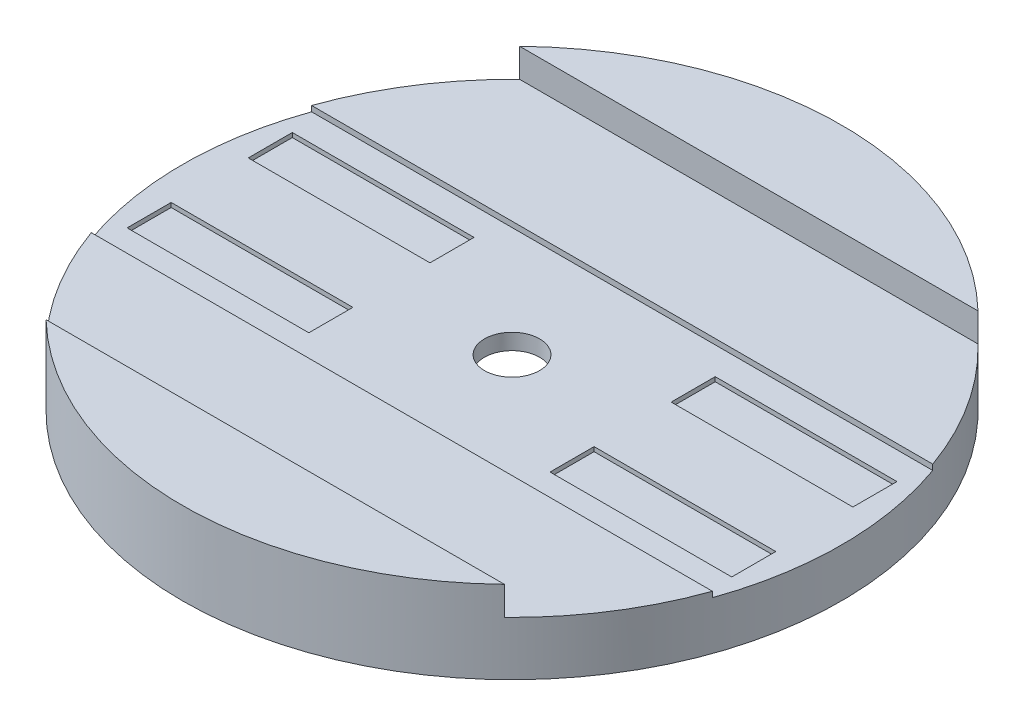
ISO-10303-21;
HEADER;
FILE_DESCRIPTION(('STEP AP214'),'2;1');
FILE_NAME('part.step','',(''),(''),'','','');
FILE_SCHEMA(('AUTOMOTIVE_DESIGN { 1 0 10303 214 1 1 1 1 }'));
ENDSEC;
DATA;
#1=APPLICATION_CONTEXT('core data for automotive mechanical design processes');
#2=APPLICATION_PROTOCOL_DEFINITION('international standard','automotive_design',2000,#1);
#3=PRODUCT_CONTEXT('',#1,'mechanical');
#4=PRODUCT('Part','Part','',(#3));
#5=PRODUCT_RELATED_PRODUCT_CATEGORY('part','',(#4));
#6=PRODUCT_DEFINITION_FORMATION('','',#4);
#7=PRODUCT_DEFINITION_CONTEXT('part definition',#1,'design');
#8=PRODUCT_DEFINITION('design','',#6,#7);
#9=PRODUCT_DEFINITION_SHAPE('','',#8);
#10=(LENGTH_UNIT() NAMED_UNIT(*) SI_UNIT(.MILLI.,.METRE.));
#11=(NAMED_UNIT(*) PLANE_ANGLE_UNIT() SI_UNIT($,.RADIAN.));
#12=(NAMED_UNIT(*) SI_UNIT($,.STERADIAN.) SOLID_ANGLE_UNIT());
#13=UNCERTAINTY_MEASURE_WITH_UNIT(LENGTH_MEASURE(1.E-05),#10,'distance_accuracy_value','');
#14=(GEOMETRIC_REPRESENTATION_CONTEXT(3) GLOBAL_UNCERTAINTY_ASSIGNED_CONTEXT((#13)) GLOBAL_UNIT_ASSIGNED_CONTEXT((#10,
#11,#12)) REPRESENTATION_CONTEXT('',''));
#15=CARTESIAN_POINT('',(0.,0.,0.));
#16=DIRECTION('',(0.,0.,1.));
#17=DIRECTION('',(1.,0.,0.));
#18=AXIS2_PLACEMENT_3D('',#15,#16,#17);
#19=CARTESIAN_POINT('',(0.,-7.554,0.));
#20=DIRECTION('',(0.,1.,0.));
#21=DIRECTION('',(0.,0.,1.));
#22=AXIS2_PLACEMENT_3D('',#19,#20,#21);
#23=CYLINDRICAL_SURFACE('',#22,6.35);
#24=CARTESIAN_POINT('',(0.,7.5,0.));
#25=DIRECTION('',(0.,-1.,0.));
#26=DIRECTION('',(0.,0.,-1.));
#27=AXIS2_PLACEMENT_3D('',#24,#25,#26);
#28=CIRCLE('',#27,6.35);
#29=CARTESIAN_POINT('',(0.,7.5,-6.35));
#30=VERTEX_POINT('',#29);
#31=EDGE_CURVE('E375',#30,#30,#28,.F.);
#32=ORIENTED_EDGE('',*,*,#31,.F.);
#33=EDGE_LOOP('',(#32));
#34=FACE_BOUND('',#33,.T.);
#35=CARTESIAN_POINT('',(0.,11.176,0.));
#36=DIRECTION('',(0.,1.,0.));
#37=DIRECTION('',(0.,0.,1.));
#38=AXIS2_PLACEMENT_3D('',#35,#36,#37);
#39=CIRCLE('',#38,6.35);
#40=CARTESIAN_POINT('',(0.,11.176,6.35));
#41=VERTEX_POINT('',#40);
#42=EDGE_CURVE('E368',#41,#41,#39,.F.);
#43=ORIENTED_EDGE('',*,*,#42,.F.);
#44=EDGE_LOOP('',(#43));
#45=FACE_BOUND('',#44,.T.);
#46=ADVANCED_FACE('F59',(#34,#45),#23,.F.);
#47=CARTESIAN_POINT('',(-58.0079555223723,12.446,0.));
#48=DIRECTION('',(0.,1.,0.));
#49=DIRECTION('',(0.,0.,1.));
#50=AXIS2_PLACEMENT_3D('',#47,#48,#49);
#51=PLANE('',#50);
#52=DIRECTION('',(1.,0.,0.));
#53=VECTOR('',#52,1.);
#54=CARTESIAN_POINT('',(-58.0079555223722,12.446,25.4));
#55=LINE('',#54,#53);
#56=CARTESIAN_POINT('',(-71.6298820325707,12.446,25.4));
#57=VERTEX_POINT('',#56);
#58=CARTESIAN_POINT('',(71.6298820325707,12.446,25.4));
#59=VERTEX_POINT('',#58);
#60=EDGE_CURVE('E416',#57,#59,#55,.T.);
#61=ORIENTED_EDGE('',*,*,#60,.F.);
#62=CARTESIAN_POINT('',(0.,12.446,0.));
#63=DIRECTION('',(0.,1.,0.));
#64=DIRECTION('',(0.,0.,1.));
#65=AXIS2_PLACEMENT_3D('',#62,#63,#64);
#66=CIRCLE('',#65,76.);
#67=CARTESIAN_POINT('',(-52.8559164143429,12.446,54.61));
#68=VERTEX_POINT('',#67);
#69=EDGE_CURVE('E407',#57,#68,#66,.T.);
#70=ORIENTED_EDGE('',*,*,#69,.T.);
#71=DIRECTION('',(1.,0.,0.));
#72=VECTOR('',#71,1.);
#73=CARTESIAN_POINT('',(-58.0079555223723,12.446,54.61));
#74=LINE('',#73,#72);
#75=CARTESIAN_POINT('',(52.8559164143429,12.446,54.61));
#76=VERTEX_POINT('',#75);
#77=EDGE_CURVE('E378',#68,#76,#74,.T.);
#78=ORIENTED_EDGE('',*,*,#77,.T.);
#79=EDGE_CURVE('E412',#76,#59,#66,.T.);
#80=ORIENTED_EDGE('',*,*,#79,.T.);
#81=EDGE_LOOP('',(#61,#70,#78,#80));
#82=FACE_BOUND('',#81,.T.);
#83=ADVANCED_FACE('F438',(#82),#51,.T.);
#84=CARTESIAN_POINT('',(0.,19.05,0.));
#85=DIRECTION('',(0.,1.,0.));
#86=DIRECTION('',(0.,0.,1.));
#87=AXIS2_PLACEMENT_3D('',#84,#85,#86);
#88=PLANE('',#87);
#89=DIRECTION('',(-1.,0.,0.));
#90=VECTOR('',#89,1.);
#91=CARTESIAN_POINT('',(0.,19.05,-54.61));
#92=LINE('',#91,#90);
#93=CARTESIAN_POINT('',(52.8559164143428,19.05,-54.61));
#94=VERTEX_POINT('',#93);
#95=CARTESIAN_POINT('',(-52.8559164143428,19.05,-54.61));
#96=VERTEX_POINT('',#95);
#97=EDGE_CURVE('E405',#94,#96,#92,.T.);
#98=ORIENTED_EDGE('',*,*,#97,.F.);
#99=CARTESIAN_POINT('',(0.,19.05,0.));
#100=DIRECTION('',(0.,1.,0.));
#101=DIRECTION('',(0.,0.,1.));
#102=AXIS2_PLACEMENT_3D('',#99,#100,#101);
#103=CIRCLE('',#102,76.);
#104=EDGE_CURVE('E400',#94,#96,#103,.T.);
#105=ORIENTED_EDGE('',*,*,#104,.T.);
#106=EDGE_LOOP('',(#98,#105));
#107=FACE_BOUND('',#106,.T.);
#108=ADVANCED_FACE('F449',(#107),#88,.T.);
#109=CARTESIAN_POINT('',(0.,19.05,0.));
#110=DIRECTION('',(0.,-1.,0.));
#111=DIRECTION('',(0.,0.,-1.));
#112=AXIS2_PLACEMENT_3D('',#109,#110,#111);
#113=CYLINDRICAL_SURFACE('',#112,76.);
#114=CARTESIAN_POINT('',(0.,11.176,0.));
#115=DIRECTION('',(0.,1.,0.));
#116=DIRECTION('',(0.,0.,1.));
#117=AXIS2_PLACEMENT_3D('',#114,#115,#116);
#118=CIRCLE('',#117,76.);
#119=CARTESIAN_POINT('',(71.6298820325707,11.176,25.4));
#120=VERTEX_POINT('',#119);
#121=CARTESIAN_POINT('',(71.6298820325707,11.176,-25.4000000000001));
#122=VERTEX_POINT('',#121);
#123=EDGE_CURVE('E12',#120,#122,#118,.T.);
#124=ORIENTED_EDGE('',*,*,#123,.F.);
#125=DIRECTION('',(0.,-1.,0.));
#126=VECTOR('',#125,1.);
#127=CARTESIAN_POINT('',(71.6298820325707,19.05,25.4));
#128=LINE('',#127,#126);
#129=EDGE_CURVE('E362',#120,#59,#128,.F.);
#130=ORIENTED_EDGE('',*,*,#129,.T.);
#131=ORIENTED_EDGE('',*,*,#79,.F.);
#132=DIRECTION('',(0.,-1.,0.));
#133=VECTOR('',#132,1.);
#134=CARTESIAN_POINT('',(52.8559164143429,19.05,54.61));
#135=LINE('',#134,#133);
#136=CARTESIAN_POINT('',(52.8559164143428,19.05,54.61));
#137=VERTEX_POINT('',#136);
#138=EDGE_CURVE('E384',#76,#137,#135,.F.);
#139=ORIENTED_EDGE('',*,*,#138,.T.);
#140=CARTESIAN_POINT('',(-52.8559164143429,19.05,54.61));
#141=VERTEX_POINT('',#140);
#142=EDGE_CURVE('E397',#141,#137,#103,.T.);
#143=ORIENTED_EDGE('',*,*,#142,.F.);
#144=DIRECTION('',(0.,-1.,0.));
#145=VECTOR('',#144,1.);
#146=CARTESIAN_POINT('',(-52.8559164143429,19.05,54.61));
#147=LINE('',#146,#145);
#148=EDGE_CURVE('E387',#141,#68,#147,.T.);
#149=ORIENTED_EDGE('',*,*,#148,.T.);
#150=ORIENTED_EDGE('',*,*,#69,.F.);
#151=DIRECTION('',(0.,-1.,0.));
#152=VECTOR('',#151,1.);
#153=CARTESIAN_POINT('',(-71.6298820325707,19.05,25.4));
#154=LINE('',#153,#152);
#155=CARTESIAN_POINT('',(-71.6298820325707,11.176,25.4));
#156=VERTEX_POINT('',#155);
#157=EDGE_CURVE('E365',#57,#156,#154,.T.);
#158=ORIENTED_EDGE('',*,*,#157,.T.);
#159=CARTESIAN_POINT('',(-71.6298820325707,11.176,-25.4));
#160=VERTEX_POINT('',#159);
#161=EDGE_CURVE('E63',#160,#156,#118,.T.);
#162=ORIENTED_EDGE('',*,*,#161,.F.);
#163=DIRECTION('',(0.,-1.,0.));
#164=VECTOR('',#163,1.);
#165=CARTESIAN_POINT('',(-71.6298820325707,19.05,-25.4));
#166=LINE('',#165,#164);
#167=CARTESIAN_POINT('',(-71.6298820325708,12.446,-25.4));
#168=VERTEX_POINT('',#167);
#169=EDGE_CURVE('E356',#160,#168,#166,.F.);
#170=ORIENTED_EDGE('',*,*,#169,.T.);
#171=CARTESIAN_POINT('',(-52.8559164143428,12.446,-54.61));
#172=VERTEX_POINT('',#171);
#173=EDGE_CURVE('E408',#172,#168,#66,.T.);
#174=ORIENTED_EDGE('',*,*,#173,.F.);
#175=DIRECTION('',(0.,-1.,0.));
#176=VECTOR('',#175,1.);
#177=CARTESIAN_POINT('',(-52.8559164143428,19.05,-54.61));
#178=LINE('',#177,#176);
#179=EDGE_CURVE('E390',#172,#96,#178,.F.);
#180=ORIENTED_EDGE('',*,*,#179,.T.);
#181=ORIENTED_EDGE('',*,*,#104,.F.);
#182=DIRECTION('',(0.,-1.,0.));
#183=VECTOR('',#182,1.);
#184=CARTESIAN_POINT('',(52.8559164143428,19.05,-54.61));
#185=LINE('',#184,#183);
#186=CARTESIAN_POINT('',(52.8559164143428,12.446,-54.61));
#187=VERTEX_POINT('',#186);
#188=EDGE_CURVE('E393',#94,#187,#185,.T.);
#189=ORIENTED_EDGE('',*,*,#188,.T.);
#190=CARTESIAN_POINT('',(71.6298820325707,12.446,-25.4000000000001));
#191=VERTEX_POINT('',#190);
#192=EDGE_CURVE('E411',#191,#187,#66,.T.);
#193=ORIENTED_EDGE('',*,*,#192,.F.);
#194=DIRECTION('',(0.,-1.,0.));
#195=VECTOR('',#194,1.);
#196=CARTESIAN_POINT('',(71.6298820325707,19.05,-25.4000000000001));
#197=LINE('',#196,#195);
#198=EDGE_CURVE('E359',#191,#122,#197,.T.);
#199=ORIENTED_EDGE('',*,*,#198,.T.);
#200=EDGE_LOOP('',(#124,#130,#131,#139,#143,#149,#150,#158,#162,#170,#174,#180,#181,#189,#193,#199));
#201=FACE_BOUND('',#200,.T.);
#202=CARTESIAN_POINT('',(0.,0.,0.));
#203=DIRECTION('',(0.,1.,0.));
#204=DIRECTION('',(0.,0.,1.));
#205=AXIS2_PLACEMENT_3D('',#202,#203,#204);
#206=CIRCLE('',#205,76.);
#207=CARTESIAN_POINT('',(0.,0.,76.));
#208=VERTEX_POINT('',#207);
#209=EDGE_CURVE('E396',#208,#208,#206,.T.);
#210=ORIENTED_EDGE('',*,*,#209,.T.);
#211=EDGE_LOOP('',(#210));
#212=FACE_BOUND('',#211,.T.);
#213=ADVANCED_FACE('F61',(#201,#212),#113,.T.);
#214=DIRECTION('',(1.,0.,0.));
#215=VECTOR('',#214,1.);
#216=CARTESIAN_POINT('',(0.,19.05,54.61));
#217=LINE('',#216,#215);
#218=EDGE_CURVE('E403',#141,#137,#217,.T.);
#219=ORIENTED_EDGE('',*,*,#218,.F.);
#220=ORIENTED_EDGE('',*,*,#142,.T.);
#221=EDGE_LOOP('',(#219,#220));
#222=FACE_BOUND('',#221,.T.);
#223=ADVANCED_FACE('F452',(#222),#88,.T.);
#224=CARTESIAN_POINT('',(0.,0.,0.));
#225=DIRECTION('',(0.,1.,0.));
#226=DIRECTION('',(0.,0.,1.));
#227=AXIS2_PLACEMENT_3D('',#224,#225,#226);
#228=PLANE('',#227);
#229=CARTESIAN_POINT('',(0.,0.,0.));
#230=DIRECTION('',(0.,-1.,0.));
#231=DIRECTION('',(0.,0.,-1.));
#232=AXIS2_PLACEMENT_3D('',#229,#230,#231);
#233=CIRCLE('',#232,70.);
#234=CARTESIAN_POINT('',(0.,0.,-70.));
#235=VERTEX_POINT('',#234);
#236=EDGE_CURVE('E371',#235,#235,#233,.T.);
#237=ORIENTED_EDGE('',*,*,#236,.F.);
#238=EDGE_LOOP('',(#237));
#239=FACE_BOUND('',#238,.T.);
#240=ORIENTED_EDGE('',*,*,#209,.F.);
#241=EDGE_LOOP('',(#240));
#242=FACE_BOUND('',#241,.T.);
#243=ADVANCED_FACE('F460',(#239,#242),#228,.F.);
#244=DIRECTION('',(-1.,0.,0.));
#245=VECTOR('',#244,1.);
#246=CARTESIAN_POINT('',(-58.0079555223723,12.446,-25.4));
#247=LINE('',#246,#245);
#248=EDGE_CURVE('E415',#191,#168,#247,.T.);
#249=ORIENTED_EDGE('',*,*,#248,.F.);
#250=ORIENTED_EDGE('',*,*,#192,.T.);
#251=DIRECTION('',(-1.,0.,0.));
#252=VECTOR('',#251,1.);
#253=CARTESIAN_POINT('',(-58.0079555223723,12.446,-54.61));
#254=LINE('',#253,#252);
#255=EDGE_CURVE('E381',#187,#172,#254,.T.);
#256=ORIENTED_EDGE('',*,*,#255,.T.);
#257=ORIENTED_EDGE('',*,*,#173,.T.);
#258=EDGE_LOOP('',(#249,#250,#256,#257));
#259=FACE_BOUND('',#258,.T.);
#260=ADVANCED_FACE('F442',(#259),#51,.T.);
#261=CARTESIAN_POINT('',(-58.0079555223723,12.446,-54.61));
#262=DIRECTION('',(0.,0.,-1.));
#263=DIRECTION('',(-1.,0.,0.));
#264=AXIS2_PLACEMENT_3D('',#261,#262,#263);
#265=PLANE('',#264);
#266=ORIENTED_EDGE('',*,*,#97,.T.);
#267=ORIENTED_EDGE('',*,*,#179,.F.);
#268=ORIENTED_EDGE('',*,*,#255,.F.);
#269=ORIENTED_EDGE('',*,*,#188,.F.);
#270=EDGE_LOOP('',(#266,#267,#268,#269));
#271=FACE_BOUND('',#270,.T.);
#272=ADVANCED_FACE('F444',(#271),#265,.F.);
#273=CARTESIAN_POINT('',(-58.0079555223723,12.446,54.61));
#274=DIRECTION('',(0.,0.,1.));
#275=DIRECTION('',(1.,0.,0.));
#276=AXIS2_PLACEMENT_3D('',#273,#274,#275);
#277=PLANE('',#276);
#278=ORIENTED_EDGE('',*,*,#218,.T.);
#279=ORIENTED_EDGE('',*,*,#138,.F.);
#280=ORIENTED_EDGE('',*,*,#77,.F.);
#281=ORIENTED_EDGE('',*,*,#148,.F.);
#282=EDGE_LOOP('',(#278,#279,#280,#281));
#283=FACE_BOUND('',#282,.T.);
#284=ADVANCED_FACE('F476',(#283),#277,.F.);
#285=CARTESIAN_POINT('',(0.,7.5,0.));
#286=DIRECTION('',(0.,-1.,0.));
#287=DIRECTION('',(0.,0.,-1.));
#288=AXIS2_PLACEMENT_3D('',#285,#286,#287);
#289=PLANE('',#288);
#290=CARTESIAN_POINT('',(0.,7.5,0.));
#291=DIRECTION('',(0.,-1.,0.));
#292=DIRECTION('',(0.,0.,-1.));
#293=AXIS2_PLACEMENT_3D('',#290,#291,#292);
#294=CIRCLE('',#293,70.);
#295=CARTESIAN_POINT('',(0.,7.5,-70.));
#296=VERTEX_POINT('',#295);
#297=EDGE_CURVE('E372',#296,#296,#294,.T.);
#298=ORIENTED_EDGE('',*,*,#297,.T.);
#299=EDGE_LOOP('',(#298));
#300=FACE_BOUND('',#299,.T.);
#301=ORIENTED_EDGE('',*,*,#31,.T.);
#302=EDGE_LOOP('',(#301));
#303=FACE_BOUND('',#302,.T.);
#304=ADVANCED_FACE('F478',(#300,#303),#289,.T.);
#305=CARTESIAN_POINT('',(0.,7.5,0.));
#306=DIRECTION('',(0.,-1.,0.));
#307=DIRECTION('',(0.,0.,-1.));
#308=AXIS2_PLACEMENT_3D('',#305,#306,#307);
#309=CYLINDRICAL_SURFACE('',#308,70.);
#310=ORIENTED_EDGE('',*,*,#297,.F.);
#311=EDGE_LOOP('',(#310));
#312=FACE_BOUND('',#311,.T.);
#313=ORIENTED_EDGE('',*,*,#236,.T.);
#314=EDGE_LOOP('',(#313));
#315=FACE_BOUND('',#314,.T.);
#316=ADVANCED_FACE('F471',(#312,#315),#309,.F.);
#317=CARTESIAN_POINT('',(76.,11.176,0.));
#318=DIRECTION('',(0.,1.,0.));
#319=DIRECTION('',(0.,0.,1.));
#320=AXIS2_PLACEMENT_3D('',#317,#318,#319);
#321=PLANE('',#320);
#322=DIRECTION('',(0.,0.,-1.));
#323=VECTOR('',#322,1.);
#324=CARTESIAN_POINT('',(69.723,11.176,-19.05));
#325=LINE('',#324,#323);
#326=CARTESIAN_POINT('',(69.723,11.176,-8.89000000000003));
#327=VERTEX_POINT('',#326);
#328=CARTESIAN_POINT('',(69.723,11.176,-19.05));
#329=VERTEX_POINT('',#328);
#330=EDGE_CURVE('E74',#327,#329,#325,.T.);
#331=ORIENTED_EDGE('',*,*,#330,.F.);
#332=DIRECTION('',(1.,0.,0.));
#333=VECTOR('',#332,1.);
#334=CARTESIAN_POINT('',(69.723,11.176,-8.89000000000003));
#335=LINE('',#334,#333);
#336=CARTESIAN_POINT('',(27.813,11.176,-8.89000000000002));
#337=VERTEX_POINT('',#336);
#338=EDGE_CURVE('E300',#337,#327,#335,.T.);
#339=ORIENTED_EDGE('',*,*,#338,.F.);
#340=DIRECTION('',(0.,0.,1.));
#341=VECTOR('',#340,1.);
#342=CARTESIAN_POINT('',(27.813,11.176,-19.05));
#343=LINE('',#342,#341);
#344=CARTESIAN_POINT('',(27.813,11.176,-19.05));
#345=VERTEX_POINT('',#344);
#346=EDGE_CURVE('E303',#345,#337,#343,.T.);
#347=ORIENTED_EDGE('',*,*,#346,.F.);
#348=DIRECTION('',(-1.,0.,0.));
#349=VECTOR('',#348,1.);
#350=CARTESIAN_POINT('',(69.723,11.176,-19.05));
#351=LINE('',#350,#349);
#352=EDGE_CURVE('E307',#329,#345,#351,.T.);
#353=ORIENTED_EDGE('',*,*,#352,.F.);
#354=EDGE_LOOP('',(#331,#339,#347,#353));
#355=FACE_BOUND('',#354,.T.);
#356=DIRECTION('',(1.,0.,0.));
#357=VECTOR('',#356,1.);
#358=CARTESIAN_POINT('',(69.723,11.176,19.05));
#359=LINE('',#358,#357);
#360=CARTESIAN_POINT('',(27.813,11.176,19.05));
#361=VERTEX_POINT('',#360);
#362=CARTESIAN_POINT('',(69.723,11.176,19.05));
#363=VERTEX_POINT('',#362);
#364=EDGE_CURVE('E82',#361,#363,#359,.T.);
#365=ORIENTED_EDGE('',*,*,#364,.F.);
#366=DIRECTION('',(0.,0.,1.));
#367=VECTOR('',#366,1.);
#368=CARTESIAN_POINT('',(27.813,11.176,19.05));
#369=LINE('',#368,#367);
#370=CARTESIAN_POINT('',(27.813,11.176,8.89000000000001));
#371=VERTEX_POINT('',#370);
#372=EDGE_CURVE('E270',#371,#361,#369,.T.);
#373=ORIENTED_EDGE('',*,*,#372,.F.);
#374=DIRECTION('',(-1.,0.,0.));
#375=VECTOR('',#374,1.);
#376=CARTESIAN_POINT('',(69.723,11.176,8.89));
#377=LINE('',#376,#375);
#378=CARTESIAN_POINT('',(69.723,11.176,8.89));
#379=VERTEX_POINT('',#378);
#380=EDGE_CURVE('E273',#379,#371,#377,.T.);
#381=ORIENTED_EDGE('',*,*,#380,.F.);
#382=DIRECTION('',(0.,0.,-1.));
#383=VECTOR('',#382,1.);
#384=CARTESIAN_POINT('',(69.723,11.176,19.05));
#385=LINE('',#384,#383);
#386=EDGE_CURVE('E277',#363,#379,#385,.T.);
#387=ORIENTED_EDGE('',*,*,#386,.F.);
#388=EDGE_LOOP('',(#365,#373,#381,#387));
#389=FACE_BOUND('',#388,.T.);
#390=DIRECTION('',(0.,0.,1.));
#391=VECTOR('',#390,1.);
#392=CARTESIAN_POINT('',(-69.723,11.176,19.05));
#393=LINE('',#392,#391);
#394=CARTESIAN_POINT('',(-69.723,11.176,8.89000000000001));
#395=VERTEX_POINT('',#394);
#396=CARTESIAN_POINT('',(-69.723,11.176,19.05));
#397=VERTEX_POINT('',#396);
#398=EDGE_CURVE('E222',#395,#397,#393,.T.);
#399=ORIENTED_EDGE('',*,*,#398,.F.);
#400=DIRECTION('',(-1.,0.,0.));
#401=VECTOR('',#400,1.);
#402=CARTESIAN_POINT('',(-69.723,11.176,8.89000000000001));
#403=LINE('',#402,#401);
#404=CARTESIAN_POINT('',(-27.813,11.176,8.89000000000001));
#405=VERTEX_POINT('',#404);
#406=EDGE_CURVE('E232',#405,#395,#403,.T.);
#407=ORIENTED_EDGE('',*,*,#406,.F.);
#408=DIRECTION('',(0.,0.,-1.));
#409=VECTOR('',#408,1.);
#410=CARTESIAN_POINT('',(-27.813,11.176,19.05));
#411=LINE('',#410,#409);
#412=CARTESIAN_POINT('',(-27.813,11.176,19.05));
#413=VERTEX_POINT('',#412);
#414=EDGE_CURVE('E237',#413,#405,#411,.T.);
#415=ORIENTED_EDGE('',*,*,#414,.F.);
#416=DIRECTION('',(1.,0.,0.));
#417=VECTOR('',#416,1.);
#418=CARTESIAN_POINT('',(-69.723,11.176,19.05));
#419=LINE('',#418,#417);
#420=EDGE_CURVE('E243',#397,#413,#419,.T.);
#421=ORIENTED_EDGE('',*,*,#420,.F.);
#422=EDGE_LOOP('',(#399,#407,#415,#421));
#423=FACE_BOUND('',#422,.T.);
#424=DIRECTION('',(0.,0.,1.));
#425=VECTOR('',#424,1.);
#426=CARTESIAN_POINT('',(-69.723,11.176,-19.05));
#427=LINE('',#426,#425);
#428=CARTESIAN_POINT('',(-69.723,11.176,-19.05));
#429=VERTEX_POINT('',#428);
#430=CARTESIAN_POINT('',(-69.723,11.176,-8.89000000000001));
#431=VERTEX_POINT('',#430);
#432=EDGE_CURVE('E244',#429,#431,#427,.T.);
#433=ORIENTED_EDGE('',*,*,#432,.F.);
#434=DIRECTION('',(-1.,0.,0.));
#435=VECTOR('',#434,1.);
#436=CARTESIAN_POINT('',(-69.723,11.176,-19.05));
#437=LINE('',#436,#435);
#438=CARTESIAN_POINT('',(-27.813,11.176,-19.05));
#439=VERTEX_POINT('',#438);
#440=EDGE_CURVE('E325',#439,#429,#437,.T.);
#441=ORIENTED_EDGE('',*,*,#440,.F.);
#442=DIRECTION('',(0.,0.,-1.));
#443=VECTOR('',#442,1.);
#444=CARTESIAN_POINT('',(-27.813,11.176,-19.05));
#445=LINE('',#444,#443);
#446=CARTESIAN_POINT('',(-27.813,11.176,-8.89000000000001));
#447=VERTEX_POINT('',#446);
#448=EDGE_CURVE('E337',#447,#439,#445,.T.);
#449=ORIENTED_EDGE('',*,*,#448,.F.);
#450=DIRECTION('',(1.,0.,0.));
#451=VECTOR('',#450,1.);
#452=CARTESIAN_POINT('',(-69.723,11.176,-8.89000000000001));
#453=LINE('',#452,#451);
#454=EDGE_CURVE('E246',#431,#447,#453,.T.);
#455=ORIENTED_EDGE('',*,*,#454,.F.);
#456=EDGE_LOOP('',(#433,#441,#449,#455));
#457=FACE_BOUND('',#456,.T.);
#458=ORIENTED_EDGE('',*,*,#123,.T.);
#459=DIRECTION('',(-1.,0.,0.));
#460=VECTOR('',#459,1.);
#461=CARTESIAN_POINT('',(76.,11.176,-25.4000000000001));
#462=LINE('',#461,#460);
#463=EDGE_CURVE('E344',#122,#160,#462,.T.);
#464=ORIENTED_EDGE('',*,*,#463,.T.);
#465=ORIENTED_EDGE('',*,*,#161,.T.);
#466=DIRECTION('',(1.,0.,0.));
#467=VECTOR('',#466,1.);
#468=CARTESIAN_POINT('',(76.,11.176,25.4));
#469=LINE('',#468,#467);
#470=EDGE_CURVE('E353',#156,#120,#469,.T.);
#471=ORIENTED_EDGE('',*,*,#470,.T.);
#472=EDGE_LOOP('',(#458,#464,#465,#471));
#473=FACE_BOUND('',#472,.T.);
#474=ORIENTED_EDGE('',*,*,#42,.T.);
#475=EDGE_LOOP('',(#474));
#476=FACE_BOUND('',#475,.T.);
#477=ADVANCED_FACE('F240',(#355,#389,#423,#457,#473,#476),#321,.T.);
#478=CARTESIAN_POINT('',(76.,11.176,25.4));
#479=DIRECTION('',(0.,0.,1.));
#480=DIRECTION('',(1.,0.,0.));
#481=AXIS2_PLACEMENT_3D('',#478,#479,#480);
#482=PLANE('',#481);
#483=ORIENTED_EDGE('',*,*,#60,.T.);
#484=ORIENTED_EDGE('',*,*,#129,.F.);
#485=ORIENTED_EDGE('',*,*,#470,.F.);
#486=ORIENTED_EDGE('',*,*,#157,.F.);
#487=EDGE_LOOP('',(#483,#484,#485,#486));
#488=FACE_BOUND('',#487,.T.);
#489=ADVANCED_FACE('F426',(#488),#482,.F.);
#490=CARTESIAN_POINT('',(76.,11.176,-25.4000000000001));
#491=DIRECTION('',(0.,0.,-1.));
#492=DIRECTION('',(-1.,0.,0.));
#493=AXIS2_PLACEMENT_3D('',#490,#491,#492);
#494=PLANE('',#493);
#495=ORIENTED_EDGE('',*,*,#248,.T.);
#496=ORIENTED_EDGE('',*,*,#169,.F.);
#497=ORIENTED_EDGE('',*,*,#463,.F.);
#498=ORIENTED_EDGE('',*,*,#198,.F.);
#499=EDGE_LOOP('',(#495,#496,#497,#498));
#500=FACE_BOUND('',#499,.T.);
#501=ADVANCED_FACE('F440',(#500),#494,.F.);
#502=CARTESIAN_POINT('',(-69.723,10.16,-19.05));
#503=DIRECTION('',(-1.,0.,0.));
#504=DIRECTION('',(0.,0.,1.));
#505=AXIS2_PLACEMENT_3D('',#502,#503,#504);
#506=PLANE('',#505);
#507=ORIENTED_EDGE('',*,*,#432,.T.);
#508=DIRECTION('',(0.,1.,0.));
#509=VECTOR('',#508,1.);
#510=CARTESIAN_POINT('',(-69.723,10.16,-8.89000000000001));
#511=LINE('',#510,#509);
#512=CARTESIAN_POINT('',(-69.723,10.16,-8.89000000000001));
#513=VERTEX_POINT('',#512);
#514=EDGE_CURVE('E333',#513,#431,#511,.T.);
#515=ORIENTED_EDGE('',*,*,#514,.F.);
#516=DIRECTION('',(0.,0.,1.));
#517=VECTOR('',#516,1.);
#518=CARTESIAN_POINT('',(-69.723,10.16,-19.05));
#519=LINE('',#518,#517);
#520=CARTESIAN_POINT('',(-69.723,10.16,-19.05));
#521=VERTEX_POINT('',#520);
#522=EDGE_CURVE('E321',#521,#513,#519,.T.);
#523=ORIENTED_EDGE('',*,*,#522,.F.);
#524=DIRECTION('',(0.,1.,0.));
#525=VECTOR('',#524,1.);
#526=CARTESIAN_POINT('',(-69.723,10.16,-19.05));
#527=LINE('',#526,#525);
#528=EDGE_CURVE('E342',#521,#429,#527,.T.);
#529=ORIENTED_EDGE('',*,*,#528,.T.);
#530=EDGE_LOOP('',(#507,#515,#523,#529));
#531=FACE_BOUND('',#530,.T.);
#532=ADVANCED_FACE('F493',(#531),#506,.F.);
#533=CARTESIAN_POINT('',(-69.723,10.16,-19.05));
#534=DIRECTION('',(0.,0.,-1.));
#535=DIRECTION('',(-1.,0.,0.));
#536=AXIS2_PLACEMENT_3D('',#533,#534,#535);
#537=PLANE('',#536);
#538=ORIENTED_EDGE('',*,*,#440,.T.);
#539=ORIENTED_EDGE('',*,*,#528,.F.);
#540=DIRECTION('',(-1.,0.,0.));
#541=VECTOR('',#540,1.);
#542=CARTESIAN_POINT('',(-69.723,10.16,-19.05));
#543=LINE('',#542,#541);
#544=CARTESIAN_POINT('',(-27.813,10.16,-19.05));
#545=VERTEX_POINT('',#544);
#546=EDGE_CURVE('E331',#545,#521,#543,.T.);
#547=ORIENTED_EDGE('',*,*,#546,.F.);
#548=DIRECTION('',(0.,1.,0.));
#549=VECTOR('',#548,1.);
#550=CARTESIAN_POINT('',(-27.813,10.16,-19.05));
#551=LINE('',#550,#549);
#552=EDGE_CURVE('E345',#545,#439,#551,.T.);
#553=ORIENTED_EDGE('',*,*,#552,.T.);
#554=EDGE_LOOP('',(#538,#539,#547,#553));
#555=FACE_BOUND('',#554,.T.);
#556=ADVANCED_FACE('F501',(#555),#537,.F.);
#557=CARTESIAN_POINT('',(-27.813,10.16,-19.05));
#558=DIRECTION('',(1.,0.,0.));
#559=DIRECTION('',(0.,0.,-1.));
#560=AXIS2_PLACEMENT_3D('',#557,#558,#559);
#561=PLANE('',#560);
#562=ORIENTED_EDGE('',*,*,#448,.T.);
#563=ORIENTED_EDGE('',*,*,#552,.F.);
#564=DIRECTION('',(0.,0.,-1.));
#565=VECTOR('',#564,1.);
#566=CARTESIAN_POINT('',(-27.813,10.16,-19.05));
#567=LINE('',#566,#565);
#568=CARTESIAN_POINT('',(-27.813,10.16,-8.89000000000001));
#569=VERTEX_POINT('',#568);
#570=EDGE_CURVE('E328',#569,#545,#567,.T.);
#571=ORIENTED_EDGE('',*,*,#570,.F.);
#572=DIRECTION('',(0.,1.,0.));
#573=VECTOR('',#572,1.);
#574=CARTESIAN_POINT('',(-27.813,10.16,-8.89000000000001));
#575=LINE('',#574,#573);
#576=EDGE_CURVE('E347',#569,#447,#575,.T.);
#577=ORIENTED_EDGE('',*,*,#576,.T.);
#578=EDGE_LOOP('',(#562,#563,#571,#577));
#579=FACE_BOUND('',#578,.T.);
#580=ADVANCED_FACE('F507',(#579),#561,.F.);
#581=CARTESIAN_POINT('',(-69.723,10.16,-8.89000000000001));
#582=DIRECTION('',(0.,0.,1.));
#583=DIRECTION('',(1.,0.,0.));
#584=AXIS2_PLACEMENT_3D('',#581,#582,#583);
#585=PLANE('',#584);
#586=ORIENTED_EDGE('',*,*,#454,.T.);
#587=ORIENTED_EDGE('',*,*,#576,.F.);
#588=DIRECTION('',(1.,0.,0.));
#589=VECTOR('',#588,1.);
#590=CARTESIAN_POINT('',(-69.723,10.16,-8.89000000000001));
#591=LINE('',#590,#589);
#592=EDGE_CURVE('E324',#513,#569,#591,.T.);
#593=ORIENTED_EDGE('',*,*,#592,.F.);
#594=ORIENTED_EDGE('',*,*,#514,.T.);
#595=EDGE_LOOP('',(#586,#587,#593,#594));
#596=FACE_BOUND('',#595,.T.);
#597=ADVANCED_FACE('F503',(#596),#585,.F.);
#598=CARTESIAN_POINT('',(0.,10.16,0.));
#599=DIRECTION('',(0.,1.,0.));
#600=DIRECTION('',(0.,0.,1.));
#601=AXIS2_PLACEMENT_3D('',#598,#599,#600);
#602=PLANE('',#601);
#603=ORIENTED_EDGE('',*,*,#522,.T.);
#604=ORIENTED_EDGE('',*,*,#592,.T.);
#605=ORIENTED_EDGE('',*,*,#570,.T.);
#606=ORIENTED_EDGE('',*,*,#546,.T.);
#607=EDGE_LOOP('',(#603,#604,#605,#606));
#608=FACE_BOUND('',#607,.T.);
#609=ADVANCED_FACE('F506',(#608),#602,.T.);
#610=CARTESIAN_POINT('',(-69.723,10.16,19.05));
#611=DIRECTION('',(-1.,0.,0.));
#612=DIRECTION('',(0.,0.,1.));
#613=AXIS2_PLACEMENT_3D('',#610,#611,#612);
#614=PLANE('',#613);
#615=ORIENTED_EDGE('',*,*,#398,.T.);
#616=DIRECTION('',(0.,1.,0.));
#617=VECTOR('',#616,1.);
#618=CARTESIAN_POINT('',(-69.723,10.16,19.05));
#619=LINE('',#618,#617);
#620=CARTESIAN_POINT('',(-69.723,10.16,19.05));
#621=VERTEX_POINT('',#620);
#622=EDGE_CURVE('E254',#621,#397,#619,.T.);
#623=ORIENTED_EDGE('',*,*,#622,.F.);
#624=DIRECTION('',(0.,0.,1.));
#625=VECTOR('',#624,1.);
#626=CARTESIAN_POINT('',(-69.723,10.16,19.05));
#627=LINE('',#626,#625);
#628=CARTESIAN_POINT('',(-69.723,10.16,8.89000000000001));
#629=VERTEX_POINT('',#628);
#630=EDGE_CURVE('E225',#629,#621,#627,.T.);
#631=ORIENTED_EDGE('',*,*,#630,.F.);
#632=DIRECTION('',(0.,1.,0.));
#633=VECTOR('',#632,1.);
#634=CARTESIAN_POINT('',(-69.723,10.16,8.89000000000001));
#635=LINE('',#634,#633);
#636=EDGE_CURVE('E218',#629,#395,#635,.T.);
#637=ORIENTED_EDGE('',*,*,#636,.T.);
#638=EDGE_LOOP('',(#615,#623,#631,#637));
#639=FACE_BOUND('',#638,.T.);
#640=ADVANCED_FACE('F220',(#639),#614,.F.);
#641=CARTESIAN_POINT('',(-69.723,10.16,8.89000000000001));
#642=DIRECTION('',(0.,0.,-1.));
#643=DIRECTION('',(-1.,0.,0.));
#644=AXIS2_PLACEMENT_3D('',#641,#642,#643);
#645=PLANE('',#644);
#646=ORIENTED_EDGE('',*,*,#406,.T.);
#647=ORIENTED_EDGE('',*,*,#636,.F.);
#648=DIRECTION('',(-1.,0.,0.));
#649=VECTOR('',#648,1.);
#650=CARTESIAN_POINT('',(-69.723,10.16,8.89000000000001));
#651=LINE('',#650,#649);
#652=CARTESIAN_POINT('',(-27.813,10.16,8.89000000000001));
#653=VERTEX_POINT('',#652);
#654=EDGE_CURVE('E251',#653,#629,#651,.T.);
#655=ORIENTED_EDGE('',*,*,#654,.F.);
#656=DIRECTION('',(0.,1.,0.));
#657=VECTOR('',#656,1.);
#658=CARTESIAN_POINT('',(-27.813,10.16,8.89000000000001));
#659=LINE('',#658,#657);
#660=EDGE_CURVE('E229',#653,#405,#659,.T.);
#661=ORIENTED_EDGE('',*,*,#660,.T.);
#662=EDGE_LOOP('',(#646,#647,#655,#661));
#663=FACE_BOUND('',#662,.T.);
#664=ADVANCED_FACE('F233',(#663),#645,.F.);
#665=CARTESIAN_POINT('',(-27.813,10.16,19.05));
#666=DIRECTION('',(1.,0.,0.));
#667=DIRECTION('',(0.,0.,-1.));
#668=AXIS2_PLACEMENT_3D('',#665,#666,#667);
#669=PLANE('',#668);
#670=ORIENTED_EDGE('',*,*,#414,.T.);
#671=ORIENTED_EDGE('',*,*,#660,.F.);
#672=DIRECTION('',(0.,0.,-1.));
#673=VECTOR('',#672,1.);
#674=CARTESIAN_POINT('',(-27.813,10.16,19.05));
#675=LINE('',#674,#673);
#676=CARTESIAN_POINT('',(-27.813,10.16,19.05));
#677=VERTEX_POINT('',#676);
#678=EDGE_CURVE('E253',#677,#653,#675,.T.);
#679=ORIENTED_EDGE('',*,*,#678,.F.);
#680=DIRECTION('',(0.,1.,0.));
#681=VECTOR('',#680,1.);
#682=CARTESIAN_POINT('',(-27.813,10.16,19.05));
#683=LINE('',#682,#681);
#684=EDGE_CURVE('E773',#677,#413,#683,.T.);
#685=ORIENTED_EDGE('',*,*,#684,.T.);
#686=EDGE_LOOP('',(#670,#671,#679,#685));
#687=FACE_BOUND('',#686,.T.);
#688=ADVANCED_FACE('F563',(#687),#669,.F.);
#689=CARTESIAN_POINT('',(-69.723,10.16,19.05));
#690=DIRECTION('',(0.,0.,1.));
#691=DIRECTION('',(1.,0.,0.));
#692=AXIS2_PLACEMENT_3D('',#689,#690,#691);
#693=PLANE('',#692);
#694=ORIENTED_EDGE('',*,*,#420,.T.);
#695=ORIENTED_EDGE('',*,*,#684,.F.);
#696=DIRECTION('',(1.,0.,0.));
#697=VECTOR('',#696,1.);
#698=CARTESIAN_POINT('',(-69.723,10.16,19.05));
#699=LINE('',#698,#697);
#700=EDGE_CURVE('E257',#621,#677,#699,.T.);
#701=ORIENTED_EDGE('',*,*,#700,.F.);
#702=ORIENTED_EDGE('',*,*,#622,.T.);
#703=EDGE_LOOP('',(#694,#695,#701,#702));
#704=FACE_BOUND('',#703,.T.);
#705=ADVANCED_FACE('F559',(#704),#693,.F.);
#706=CARTESIAN_POINT('',(0.,10.16,0.));
#707=DIRECTION('',(0.,-1.,0.));
#708=DIRECTION('',(0.,0.,-1.));
#709=AXIS2_PLACEMENT_3D('',#706,#707,#708);
#710=PLANE('',#709);
#711=ORIENTED_EDGE('',*,*,#630,.T.);
#712=ORIENTED_EDGE('',*,*,#700,.T.);
#713=ORIENTED_EDGE('',*,*,#678,.T.);
#714=ORIENTED_EDGE('',*,*,#654,.T.);
#715=EDGE_LOOP('',(#711,#712,#713,#714));
#716=FACE_BOUND('',#715,.T.);
#717=ADVANCED_FACE('F556',(#716),#710,.F.);
#718=CARTESIAN_POINT('',(69.723,10.16,19.05));
#719=DIRECTION('',(0.,0.,1.));
#720=DIRECTION('',(1.,0.,0.));
#721=AXIS2_PLACEMENT_3D('',#718,#719,#720);
#722=PLANE('',#721);
#723=ORIENTED_EDGE('',*,*,#364,.T.);
#724=DIRECTION('',(0.,1.,0.));
#725=VECTOR('',#724,1.);
#726=CARTESIAN_POINT('',(69.723,10.16,19.05));
#727=LINE('',#726,#725);
#728=CARTESIAN_POINT('',(69.723,10.16,19.05));
#729=VERTEX_POINT('',#728);
#730=EDGE_CURVE('E261',#729,#363,#727,.T.);
#731=ORIENTED_EDGE('',*,*,#730,.F.);
#732=DIRECTION('',(1.,0.,0.));
#733=VECTOR('',#732,1.);
#734=CARTESIAN_POINT('',(69.723,10.16,19.05));
#735=LINE('',#734,#733);
#736=CARTESIAN_POINT('',(27.813,10.16,19.05));
#737=VERTEX_POINT('',#736);
#738=EDGE_CURVE('E274',#737,#729,#735,.T.);
#739=ORIENTED_EDGE('',*,*,#738,.F.);
#740=DIRECTION('',(0.,1.,0.));
#741=VECTOR('',#740,1.);
#742=CARTESIAN_POINT('',(27.813,10.16,19.05));
#743=LINE('',#742,#741);
#744=EDGE_CURVE('E268',#737,#361,#743,.T.);
#745=ORIENTED_EDGE('',*,*,#744,.T.);
#746=EDGE_LOOP('',(#723,#731,#739,#745));
#747=FACE_BOUND('',#746,.T.);
#748=ADVANCED_FACE('F546',(#747),#722,.F.);
#749=CARTESIAN_POINT('',(27.813,10.16,19.05));
#750=DIRECTION('',(-1.,0.,0.));
#751=DIRECTION('',(0.,0.,1.));
#752=AXIS2_PLACEMENT_3D('',#749,#750,#751);
#753=PLANE('',#752);
#754=ORIENTED_EDGE('',*,*,#372,.T.);
#755=ORIENTED_EDGE('',*,*,#744,.F.);
#756=DIRECTION('',(0.,0.,1.));
#757=VECTOR('',#756,1.);
#758=CARTESIAN_POINT('',(27.813,10.16,19.05));
#759=LINE('',#758,#757);
#760=CARTESIAN_POINT('',(27.813,10.16,8.89000000000001));
#761=VERTEX_POINT('',#760);
#762=EDGE_CURVE('E263',#761,#737,#759,.T.);
#763=ORIENTED_EDGE('',*,*,#762,.F.);
#764=DIRECTION('',(0.,1.,0.));
#765=VECTOR('',#764,1.);
#766=CARTESIAN_POINT('',(27.813,10.16,8.89000000000001));
#767=LINE('',#766,#765);
#768=EDGE_CURVE('E266',#761,#371,#767,.T.);
#769=ORIENTED_EDGE('',*,*,#768,.T.);
#770=EDGE_LOOP('',(#754,#755,#763,#769));
#771=FACE_BOUND('',#770,.T.);
#772=ADVANCED_FACE('F542',(#771),#753,.F.);
#773=CARTESIAN_POINT('',(69.723,10.16,8.89));
#774=DIRECTION('',(0.,0.,-1.));
#775=DIRECTION('',(-1.,0.,0.));
#776=AXIS2_PLACEMENT_3D('',#773,#774,#775);
#777=PLANE('',#776);
#778=ORIENTED_EDGE('',*,*,#380,.T.);
#779=ORIENTED_EDGE('',*,*,#768,.F.);
#780=DIRECTION('',(-1.,0.,0.));
#781=VECTOR('',#780,1.);
#782=CARTESIAN_POINT('',(69.723,10.16,8.89));
#783=LINE('',#782,#781);
#784=CARTESIAN_POINT('',(69.723,10.16,8.89));
#785=VERTEX_POINT('',#784);
#786=EDGE_CURVE('E283',#785,#761,#783,.T.);
#787=ORIENTED_EDGE('',*,*,#786,.F.);
#788=DIRECTION('',(0.,1.,0.));
#789=VECTOR('',#788,1.);
#790=CARTESIAN_POINT('',(69.723,10.16,8.89));
#791=LINE('',#790,#789);
#792=EDGE_CURVE('E264',#785,#379,#791,.T.);
#793=ORIENTED_EDGE('',*,*,#792,.T.);
#794=EDGE_LOOP('',(#778,#779,#787,#793));
#795=FACE_BOUND('',#794,.T.);
#796=ADVANCED_FACE('F545',(#795),#777,.F.);
#797=CARTESIAN_POINT('',(69.723,10.16,19.05));
#798=DIRECTION('',(1.,0.,0.));
#799=DIRECTION('',(0.,0.,-1.));
#800=AXIS2_PLACEMENT_3D('',#797,#798,#799);
#801=PLANE('',#800);
#802=ORIENTED_EDGE('',*,*,#386,.T.);
#803=ORIENTED_EDGE('',*,*,#792,.F.);
#804=DIRECTION('',(0.,0.,-1.));
#805=VECTOR('',#804,1.);
#806=CARTESIAN_POINT('',(69.723,10.16,19.05));
#807=LINE('',#806,#805);
#808=EDGE_CURVE('E286',#729,#785,#807,.T.);
#809=ORIENTED_EDGE('',*,*,#808,.F.);
#810=ORIENTED_EDGE('',*,*,#730,.T.);
#811=EDGE_LOOP('',(#802,#803,#809,#810));
#812=FACE_BOUND('',#811,.T.);
#813=ADVANCED_FACE('F540',(#812),#801,.F.);
#814=CARTESIAN_POINT('',(0.,10.16,0.));
#815=DIRECTION('',(0.,-1.,0.));
#816=DIRECTION('',(0.,0.,-1.));
#817=AXIS2_PLACEMENT_3D('',#814,#815,#816);
#818=PLANE('',#817);
#819=ORIENTED_EDGE('',*,*,#738,.T.);
#820=ORIENTED_EDGE('',*,*,#808,.T.);
#821=ORIENTED_EDGE('',*,*,#786,.T.);
#822=ORIENTED_EDGE('',*,*,#762,.T.);
#823=EDGE_LOOP('',(#819,#820,#821,#822));
#824=FACE_BOUND('',#823,.T.);
#825=ADVANCED_FACE('F537',(#824),#818,.F.);
#826=CARTESIAN_POINT('',(69.723,10.16,-19.05));
#827=DIRECTION('',(1.,0.,0.));
#828=DIRECTION('',(0.,0.,-1.));
#829=AXIS2_PLACEMENT_3D('',#826,#827,#828);
#830=PLANE('',#829);
#831=ORIENTED_EDGE('',*,*,#330,.T.);
#832=DIRECTION('',(0.,1.,0.));
#833=VECTOR('',#832,1.);
#834=CARTESIAN_POINT('',(69.723,10.16,-19.05));
#835=LINE('',#834,#833);
#836=CARTESIAN_POINT('',(69.723,10.16,-19.05));
#837=VERTEX_POINT('',#836);
#838=EDGE_CURVE('E291',#837,#329,#835,.T.);
#839=ORIENTED_EDGE('',*,*,#838,.F.);
#840=DIRECTION('',(0.,0.,-1.));
#841=VECTOR('',#840,1.);
#842=CARTESIAN_POINT('',(69.723,10.16,-19.05));
#843=LINE('',#842,#841);
#844=CARTESIAN_POINT('',(69.723,10.16,-8.89000000000003));
#845=VERTEX_POINT('',#844);
#846=EDGE_CURVE('E304',#845,#837,#843,.T.);
#847=ORIENTED_EDGE('',*,*,#846,.F.);
#848=DIRECTION('',(0.,1.,0.));
#849=VECTOR('',#848,1.);
#850=CARTESIAN_POINT('',(69.723,10.16,-8.89000000000003));
#851=LINE('',#850,#849);
#852=EDGE_CURVE('E298',#845,#327,#851,.T.);
#853=ORIENTED_EDGE('',*,*,#852,.T.);
#854=EDGE_LOOP('',(#831,#839,#847,#853));
#855=FACE_BOUND('',#854,.T.);
#856=ADVANCED_FACE('F527',(#855),#830,.F.);
#857=CARTESIAN_POINT('',(69.723,10.16,-8.89000000000003));
#858=DIRECTION('',(0.,0.,1.));
#859=DIRECTION('',(1.,0.,0.));
#860=AXIS2_PLACEMENT_3D('',#857,#858,#859);
#861=PLANE('',#860);
#862=ORIENTED_EDGE('',*,*,#338,.T.);
#863=ORIENTED_EDGE('',*,*,#852,.F.);
#864=DIRECTION('',(1.,0.,0.));
#865=VECTOR('',#864,1.);
#866=CARTESIAN_POINT('',(69.723,10.16,-8.89000000000003));
#867=LINE('',#866,#865);
#868=CARTESIAN_POINT('',(27.813,10.16,-8.89000000000002));
#869=VERTEX_POINT('',#868);
#870=EDGE_CURVE('E293',#869,#845,#867,.T.);
#871=ORIENTED_EDGE('',*,*,#870,.F.);
#872=DIRECTION('',(0.,1.,0.));
#873=VECTOR('',#872,1.);
#874=CARTESIAN_POINT('',(27.813,10.16,-8.89000000000002));
#875=LINE('',#874,#873);
#876=EDGE_CURVE('E296',#869,#337,#875,.T.);
#877=ORIENTED_EDGE('',*,*,#876,.T.);
#878=EDGE_LOOP('',(#862,#863,#871,#877));
#879=FACE_BOUND('',#878,.T.);
#880=ADVANCED_FACE('F523',(#879),#861,.F.);
#881=CARTESIAN_POINT('',(27.813,10.16,-19.05));
#882=DIRECTION('',(-1.,0.,0.));
#883=DIRECTION('',(0.,0.,1.));
#884=AXIS2_PLACEMENT_3D('',#881,#882,#883);
#885=PLANE('',#884);
#886=ORIENTED_EDGE('',*,*,#346,.T.);
#887=ORIENTED_EDGE('',*,*,#876,.F.);
#888=DIRECTION('',(0.,0.,1.));
#889=VECTOR('',#888,1.);
#890=CARTESIAN_POINT('',(27.813,10.16,-19.05));
#891=LINE('',#890,#889);
#892=CARTESIAN_POINT('',(27.813,10.16,-19.05));
#893=VERTEX_POINT('',#892);
#894=EDGE_CURVE('E313',#893,#869,#891,.T.);
#895=ORIENTED_EDGE('',*,*,#894,.F.);
#896=DIRECTION('',(0.,1.,0.));
#897=VECTOR('',#896,1.);
#898=CARTESIAN_POINT('',(27.813,10.16,-19.05));
#899=LINE('',#898,#897);
#900=EDGE_CURVE('E294',#893,#345,#899,.T.);
#901=ORIENTED_EDGE('',*,*,#900,.T.);
#902=EDGE_LOOP('',(#886,#887,#895,#901));
#903=FACE_BOUND('',#902,.T.);
#904=ADVANCED_FACE('F526',(#903),#885,.F.);
#905=CARTESIAN_POINT('',(69.723,10.16,-19.05));
#906=DIRECTION('',(0.,0.,-1.));
#907=DIRECTION('',(-1.,0.,0.));
#908=AXIS2_PLACEMENT_3D('',#905,#906,#907);
#909=PLANE('',#908);
#910=ORIENTED_EDGE('',*,*,#352,.T.);
#911=ORIENTED_EDGE('',*,*,#900,.F.);
#912=DIRECTION('',(-1.,0.,0.));
#913=VECTOR('',#912,1.);
#914=CARTESIAN_POINT('',(69.723,10.16,-19.05));
#915=LINE('',#914,#913);
#916=EDGE_CURVE('E316',#837,#893,#915,.T.);
#917=ORIENTED_EDGE('',*,*,#916,.F.);
#918=ORIENTED_EDGE('',*,*,#838,.T.);
#919=EDGE_LOOP('',(#910,#911,#917,#918));
#920=FACE_BOUND('',#919,.T.);
#921=ADVANCED_FACE('F521',(#920),#909,.F.);
#922=CARTESIAN_POINT('',(0.,10.16,0.));
#923=DIRECTION('',(0.,-1.,0.));
#924=DIRECTION('',(0.,0.,-1.));
#925=AXIS2_PLACEMENT_3D('',#922,#923,#924);
#926=PLANE('',#925);
#927=ORIENTED_EDGE('',*,*,#846,.T.);
#928=ORIENTED_EDGE('',*,*,#916,.T.);
#929=ORIENTED_EDGE('',*,*,#894,.T.);
#930=ORIENTED_EDGE('',*,*,#870,.T.);
#931=EDGE_LOOP('',(#927,#928,#929,#930));
#932=FACE_BOUND('',#931,.T.);
#933=ADVANCED_FACE('F518',(#932),#926,.F.);
#934=CLOSED_SHELL('',(#46,#83,#108,#213,#223,#243,#260,#272,#284,#304,#316,#477,#489,#501,#532,
#556,#580,#597,#609,#640,#664,#688,#705,#717,#748,#772,#796,#813,#825,#856,#880,#904,#921,#933));
#935=MANIFOLD_SOLID_BREP('B2',#934);
#936=ADVANCED_BREP_SHAPE_REPRESENTATION('',(#18,#935),#14);
#937=SHAPE_DEFINITION_REPRESENTATION(#9,#936);
ENDSEC;
END-ISO-10303-21;
